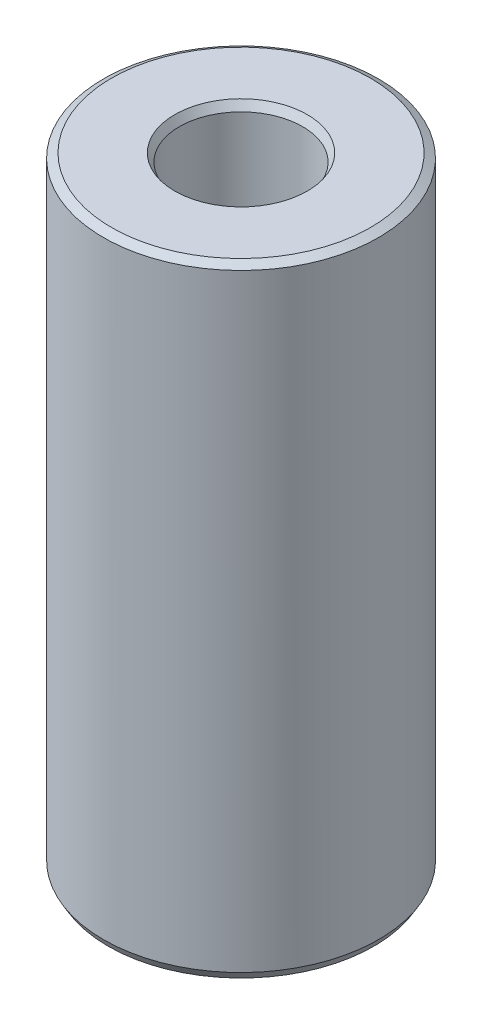
ISO-10303-21;
HEADER;
FILE_DESCRIPTION(('STEP AP214'),'2;1');
FILE_NAME('part.step','',(''),(''),'','','');
FILE_SCHEMA(('AUTOMOTIVE_DESIGN { 1 0 10303 214 1 1 1 1 }'));
ENDSEC;
DATA;
#1=APPLICATION_CONTEXT('core data for automotive mechanical design processes');
#2=APPLICATION_PROTOCOL_DEFINITION('international standard','automotive_design',2000,#1);
#3=PRODUCT_CONTEXT('',#1,'mechanical');
#4=PRODUCT('Part','Part','',(#3));
#5=PRODUCT_RELATED_PRODUCT_CATEGORY('part','',(#4));
#6=PRODUCT_DEFINITION_FORMATION('','',#4);
#7=PRODUCT_DEFINITION_CONTEXT('part definition',#1,'design');
#8=PRODUCT_DEFINITION('design','',#6,#7);
#9=PRODUCT_DEFINITION_SHAPE('','',#8);
#10=(LENGTH_UNIT() NAMED_UNIT(*) SI_UNIT(.MILLI.,.METRE.));
#11=(NAMED_UNIT(*) PLANE_ANGLE_UNIT() SI_UNIT($,.RADIAN.));
#12=(NAMED_UNIT(*) SI_UNIT($,.STERADIAN.) SOLID_ANGLE_UNIT());
#13=UNCERTAINTY_MEASURE_WITH_UNIT(LENGTH_MEASURE(1.E-05),#10,'distance_accuracy_value','');
#14=(GEOMETRIC_REPRESENTATION_CONTEXT(3) GLOBAL_UNCERTAINTY_ASSIGNED_CONTEXT((#13)) GLOBAL_UNIT_ASSIGNED_CONTEXT((#10,
#11,#12)) REPRESENTATION_CONTEXT('',''));
#15=CARTESIAN_POINT('',(0.,0.,0.));
#16=DIRECTION('',(0.,0.,1.));
#17=DIRECTION('',(1.,0.,0.));
#18=AXIS2_PLACEMENT_3D('',#15,#16,#17);
#19=CARTESIAN_POINT('',(0.,236.97446043715,0.));
#20=DIRECTION('',(0.,-1.,0.));
#21=DIRECTION('',(0.,0.,-1.));
#22=AXIS2_PLACEMENT_3D('',#19,#20,#21);
#23=CYLINDRICAL_SURFACE('',#22,52.5);
#24=CARTESIAN_POINT('',(0.,3.08121697017782,0.));
#25=DIRECTION('',(0.,1.,0.));
#26=DIRECTION('',(0.,0.,1.));
#27=AXIS2_PLACEMENT_3D('',#24,#25,#26);
#28=CIRCLE('',#27,52.5);
#29=CARTESIAN_POINT('',(0.,3.08121697017782,52.5));
#30=VERTEX_POINT('',#29);
#31=EDGE_CURVE('E10',#30,#30,#28,.T.);
#32=ORIENTED_EDGE('',*,*,#31,.T.);
#33=EDGE_LOOP('',(#32));
#34=FACE_BOUND('',#33,.T.);
#35=CARTESIAN_POINT('',(0.,235.195518989986,0.));
#36=DIRECTION('',(0.,1.,0.));
#37=DIRECTION('',(0.,0.,1.));
#38=AXIS2_PLACEMENT_3D('',#35,#36,#37);
#39=CIRCLE('',#38,52.5);
#40=CARTESIAN_POINT('',(0.,235.195518989986,-52.5));
#41=VERTEX_POINT('',#40);
#42=EDGE_CURVE('E50',#41,#41,#39,.F.);
#43=ORIENTED_EDGE('',*,*,#42,.T.);
#44=EDGE_LOOP('',(#43));
#45=FACE_BOUND('',#44,.T.);
#46=ADVANCED_FACE('F39',(#34,#45),#23,.T.);
#47=CARTESIAN_POINT('',(0.,236.97446043715,0.));
#48=DIRECTION('',(0.,1.,0.));
#49=DIRECTION('',(0.,0.,1.));
#50=AXIS2_PLACEMENT_3D('',#47,#48,#49);
#51=PLANE('',#50);
#52=CARTESIAN_POINT('',(0.,236.97446043715,0.));
#53=DIRECTION('',(0.,1.,0.));
#54=DIRECTION('',(0.,0.,1.));
#55=AXIS2_PLACEMENT_3D('',#52,#53,#54);
#56=CIRCLE('',#55,25.303635211718);
#57=CARTESIAN_POINT('',(0.,236.97446043715,25.303635211718));
#58=VERTEX_POINT('',#57);
#59=EDGE_CURVE('E58',#58,#58,#56,.F.);
#60=ORIENTED_EDGE('',*,*,#59,.T.);
#61=EDGE_LOOP('',(#60));
#62=FACE_BOUND('',#61,.T.);
#63=CARTESIAN_POINT('',(0.,236.97446043715,0.));
#64=DIRECTION('',(0.,1.,0.));
#65=DIRECTION('',(0.,0.,1.));
#66=AXIS2_PLACEMENT_3D('',#63,#64,#65);
#67=CIRCLE('',#66,49.4187830298221);
#68=CARTESIAN_POINT('',(0.,236.97446043715,-49.4187830298221));
#69=VERTEX_POINT('',#68);
#70=EDGE_CURVE('E61',#69,#69,#67,.T.);
#71=ORIENTED_EDGE('',*,*,#70,.T.);
#72=EDGE_LOOP('',(#71));
#73=FACE_BOUND('',#72,.T.);
#74=ADVANCED_FACE('F88',(#62,#73),#51,.T.);
#75=CARTESIAN_POINT('',(0.,0.,0.));
#76=DIRECTION('',(0.,1.,0.));
#77=DIRECTION('',(0.,0.,1.));
#78=AXIS2_PLACEMENT_3D('',#75,#76,#77);
#79=PLANE('',#78);
#80=CARTESIAN_POINT('',(0.,0.,0.));
#81=DIRECTION('',(0.,1.,0.));
#82=DIRECTION('',(0.,0.,1.));
#83=AXIS2_PLACEMENT_3D('',#80,#81,#82);
#84=CIRCLE('',#83,26.605910734732);
#85=CARTESIAN_POINT('',(0.,0.,26.605910734732));
#86=VERTEX_POINT('',#85);
#87=EDGE_CURVE('E51',#86,#86,#84,.T.);
#88=ORIENTED_EDGE('',*,*,#87,.T.);
#89=EDGE_LOOP('',(#88));
#90=FACE_BOUND('',#89,.T.);
#91=CARTESIAN_POINT('',(0.,0.,0.));
#92=DIRECTION('',(0.,1.,0.));
#93=DIRECTION('',(0.,0.,1.));
#94=AXIS2_PLACEMENT_3D('',#91,#92,#93);
#95=CIRCLE('',#94,50.7210585528362);
#96=CARTESIAN_POINT('',(0.,0.,50.7210585528362));
#97=VERTEX_POINT('',#96);
#98=EDGE_CURVE('E54',#97,#97,#95,.F.);
#99=ORIENTED_EDGE('',*,*,#98,.T.);
#100=EDGE_LOOP('',(#99));
#101=FACE_BOUND('',#100,.T.);
#102=ADVANCED_FACE('F83',(#90,#101),#79,.F.);
#103=CARTESIAN_POINT('',(0.,236.97446043715,0.));
#104=DIRECTION('',(0.,-1.,0.));
#105=DIRECTION('',(0.,0.,-1.));
#106=AXIS2_PLACEMENT_3D('',#103,#104,#105);
#107=CYLINDRICAL_SURFACE('',#106,23.5246937645542);
#108=CARTESIAN_POINT('',(0.,233.893243466972,0.));
#109=DIRECTION('',(0.,1.,0.));
#110=DIRECTION('',(0.,0.,1.));
#111=AXIS2_PLACEMENT_3D('',#108,#109,#110);
#112=CIRCLE('',#111,23.5246937645542);
#113=CARTESIAN_POINT('',(0.,233.893243466972,23.5246937645542));
#114=VERTEX_POINT('',#113);
#115=EDGE_CURVE('E67',#114,#114,#112,.T.);
#116=ORIENTED_EDGE('',*,*,#115,.T.);
#117=EDGE_LOOP('',(#116));
#118=FACE_BOUND('',#117,.T.);
#119=CARTESIAN_POINT('',(0.,1.77894144716378,0.));
#120=DIRECTION('',(0.,1.,0.));
#121=DIRECTION('',(0.,0.,1.));
#122=AXIS2_PLACEMENT_3D('',#119,#120,#121);
#123=CIRCLE('',#122,23.5246937645542);
#124=CARTESIAN_POINT('',(0.,1.77894144716378,23.5246937645542));
#125=VERTEX_POINT('',#124);
#126=EDGE_CURVE('E69',#125,#125,#123,.F.);
#127=ORIENTED_EDGE('',*,*,#126,.T.);
#128=EDGE_LOOP('',(#127));
#129=FACE_BOUND('',#128,.T.);
#130=ADVANCED_FACE('F71',(#118,#129),#107,.F.);
#131=CARTESIAN_POINT('',(0.,233.893243466972,0.));
#132=DIRECTION('',(0.,1.,0.));
#133=DIRECTION('',(0.,0.,1.));
#134=AXIS2_PLACEMENT_3D('',#131,#132,#133);
#135=CONICAL_SURFACE('',#134,23.5246937645542,0.5235987755983);
#136=ORIENTED_EDGE('',*,*,#59,.F.);
#137=EDGE_LOOP('',(#136));
#138=FACE_BOUND('',#137,.T.);
#139=ORIENTED_EDGE('',*,*,#115,.F.);
#140=EDGE_LOOP('',(#139));
#141=FACE_BOUND('',#140,.T.);
#142=ADVANCED_FACE('F77',(#138,#141),#135,.F.);
#143=CARTESIAN_POINT('',(0.,0.,0.));
#144=DIRECTION('',(0.,-1.,0.));
#145=DIRECTION('',(0.,0.,-1.));
#146=AXIS2_PLACEMENT_3D('',#143,#144,#145);
#147=CONICAL_SURFACE('',#146,26.605910734732,1.0471975511966);
#148=ORIENTED_EDGE('',*,*,#126,.F.);
#149=EDGE_LOOP('',(#148));
#150=FACE_BOUND('',#149,.T.);
#151=ORIENTED_EDGE('',*,*,#87,.F.);
#152=EDGE_LOOP('',(#151));
#153=FACE_BOUND('',#152,.T.);
#154=ADVANCED_FACE('F73',(#150,#153),#147,.F.);
#155=CARTESIAN_POINT('',(0.,3.08121697017782,0.));
#156=DIRECTION('',(0.,1.,0.));
#157=DIRECTION('',(0.,0.,1.));
#158=AXIS2_PLACEMENT_3D('',#155,#156,#157);
#159=CONICAL_SURFACE('',#158,52.5,0.523598775598301);
#160=ORIENTED_EDGE('',*,*,#98,.F.);
#161=EDGE_LOOP('',(#160));
#162=FACE_BOUND('',#161,.T.);
#163=ORIENTED_EDGE('',*,*,#31,.F.);
#164=EDGE_LOOP('',(#163));
#165=FACE_BOUND('',#164,.T.);
#166=ADVANCED_FACE('F76',(#162,#165),#159,.T.);
#167=CARTESIAN_POINT('',(0.,236.97446043715,0.));
#168=DIRECTION('',(0.,-1.,0.));
#169=DIRECTION('',(0.,0.,-1.));
#170=AXIS2_PLACEMENT_3D('',#167,#168,#169);
#171=CONICAL_SURFACE('',#170,49.4187830298221,1.0471975511966);
#172=CARTESIAN_POINT('',(0.,235.195518989986,-52.5));
#173=CARTESIAN_POINT('',(0.,235.21404963006,-52.467903989894));
#174=CARTESIAN_POINT('',(0.,235.232580270135,-52.435807979788));
#175=CARTESIAN_POINT('',(0.,235.269641550284,-52.3716159595759));
#176=CARTESIAN_POINT('',(0.,235.288172190359,-52.3395199494699));
#177=CARTESIAN_POINT('',(0.,235.325233470508,-52.2753279292579));
#178=CARTESIAN_POINT('',(0.,235.343764110583,-52.2432319191519));
#179=CARTESIAN_POINT('',(0.,235.380825390732,-52.1790398989398));
#180=CARTESIAN_POINT('',(0.,235.399356030807,-52.1469438888338));
#181=CARTESIAN_POINT('',(0.,235.436417310956,-52.0827518686218));
#182=CARTESIAN_POINT('',(0.,235.45494795103,-52.0506558585157));
#183=CARTESIAN_POINT('',(0.,235.49200923118,-51.9864638383037));
#184=CARTESIAN_POINT('',(0.,235.510539871254,-51.9543678281977));
#185=CARTESIAN_POINT('',(0.,235.547601151403,-51.8901758079856));
#186=CARTESIAN_POINT('',(0.,235.566131791478,-51.8580797978796));
#187=CARTESIAN_POINT('',(0.,235.603193071627,-51.7938877776676));
#188=CARTESIAN_POINT('',(0.,235.621723711702,-51.7617917675616));
#189=CARTESIAN_POINT('',(0.,235.658784991851,-51.6975997473495));
#190=CARTESIAN_POINT('',(0.,235.677315631926,-51.6655037372435));
#191=CARTESIAN_POINT('',(0.,235.714376912075,-51.6013117170315));
#192=CARTESIAN_POINT('',(0.,235.73290755215,-51.5692157069254));
#193=CARTESIAN_POINT('',(0.,235.769968832299,-51.5050236867134));
#194=CARTESIAN_POINT('',(0.,235.788499472374,-51.4729276766074));
#195=CARTESIAN_POINT('',(0.,235.825560752523,-51.4087356563954));
#196=CARTESIAN_POINT('',(0.,235.844091392597,-51.3766396462893));
#197=CARTESIAN_POINT('',(0.,235.881152672747,-51.3124476260773));
#198=CARTESIAN_POINT('',(0.,235.899683312821,-51.2803516159713));
#199=CARTESIAN_POINT('',(0.,235.936744592971,-51.2161595957592));
#200=CARTESIAN_POINT('',(0.,235.955275233045,-51.1840635856532));
#201=CARTESIAN_POINT('',(0.,235.992336513194,-51.1198715654412));
#202=CARTESIAN_POINT('',(0.,236.010867153269,-51.0877755553352));
#203=CARTESIAN_POINT('',(0.,236.047928433418,-51.0235835351231));
#204=CARTESIAN_POINT('',(0.,236.066459073493,-50.9914875250171));
#205=CARTESIAN_POINT('',(0.,236.103520353642,-50.9272955048051));
#206=CARTESIAN_POINT('',(0.,236.122050993717,-50.895199494699));
#207=CARTESIAN_POINT('',(0.,236.159112273866,-50.831007474487));
#208=CARTESIAN_POINT('',(0.,236.177642913941,-50.798911464381));
#209=CARTESIAN_POINT('',(0.,236.21470419409,-50.7347194441689));
#210=CARTESIAN_POINT('',(0.,236.233234834165,-50.7026234340629));
#211=CARTESIAN_POINT('',(0.,236.270296114314,-50.6384314138509));
#212=CARTESIAN_POINT('',(0.,236.288826754388,-50.6063354037449));
#213=CARTESIAN_POINT('',(0.,236.325888034538,-50.5421433835328));
#214=CARTESIAN_POINT('',(0.,236.344418674612,-50.5100473734268));
#215=CARTESIAN_POINT('',(0.,236.381479954762,-50.4458553532148));
#216=CARTESIAN_POINT('',(0.,236.400010594836,-50.4137593431087));
#217=CARTESIAN_POINT('',(0.,236.437071874985,-50.3495673228967));
#218=CARTESIAN_POINT('',(0.,236.45560251506,-50.3174713127907));
#219=CARTESIAN_POINT('',(0.,236.492663795209,-50.2532792925786));
#220=CARTESIAN_POINT('',(0.,236.511194435284,-50.2211832824726));
#221=CARTESIAN_POINT('',(0.,236.548255715433,-50.1569912622606));
#222=CARTESIAN_POINT('',(0.,236.566786355508,-50.1248952521546));
#223=CARTESIAN_POINT('',(0.,236.603847635657,-50.0607032319425));
#224=CARTESIAN_POINT('',(0.,236.622378275732,-50.0286072218365));
#225=CARTESIAN_POINT('',(0.,236.659439555881,-49.9644152016245));
#226=CARTESIAN_POINT('',(0.,236.677970195956,-49.9323191915184));
#227=CARTESIAN_POINT('',(0.,236.715031476105,-49.8681271713064));
#228=CARTESIAN_POINT('',(0.,236.733562116179,-49.8360311612004));
#229=CARTESIAN_POINT('',(0.,236.770623396329,-49.7718391409884));
#230=CARTESIAN_POINT('',(0.,236.789154036403,-49.7397431308823));
#231=CARTESIAN_POINT('',(0.,236.826215316553,-49.6755511106703));
#232=CARTESIAN_POINT('',(0.,236.844745956627,-49.6434551005643));
#233=CARTESIAN_POINT('',(0.,236.881807236776,-49.5792630803522));
#234=CARTESIAN_POINT('',(0.,236.900337876851,-49.5471670702462));
#235=CARTESIAN_POINT('',(0.,236.937399157,-49.4829750500342));
#236=CARTESIAN_POINT('',(0.,236.955929797075,-49.4508790399281));
#237=CARTESIAN_POINT('',(0.,236.97446043715,-49.4187830298221));
#238=B_SPLINE_CURVE_WITH_KNOTS('',3,(#172,#173,#174,#175,#176,#177,#178,#179,#180,#181,#182,
#183,#184,#185,#186,#187,#188,#189,#190,#191,#192,#193,#194,#195,#196,#197,#198,#199,#200,#201,
#202,#203,#204,#205,#206,#207,#208,#209,#210,#211,#212,#213,#214,#215,#216,#217,#218,#219,#220,
#221,#222,#223,#224,#225,#226,#227,#228,#229,#230,#231,#232,#233,#234,#235,#236,#237),
.UNSPECIFIED.,.F.,.F.,(4,2,2,2,2,2,2,2,2,2,2,2,2,2,2,2,2,2,2,2,2,2,2,2,2,2,2,2,2,2,2,2,4),(0.,
0.111183840447732,0.22236768089547,0.333551521343208,0.44473536179096,0.555919202238693,
0.667103042686431,0.778286883134169,0.889470723581921,1.00065456402966,1.11183840447739,
1.22302224492513,1.33420608537288,1.44538992582062,1.55657376626835,1.66775760671609,
1.77894144716384,1.89012528761158,2.00130912805932,2.11249296850705,2.2236768089548,
2.33486064940254,2.44604448985028,2.55722833029802,2.66841217074576,2.7795960111935,
2.89077985164124,3.00196369208898,3.11314753253672,3.22433137298446,3.3355152134322,
3.44669905387994,3.55788289432769),.UNSPECIFIED.);
#239=EDGE_CURVE('BSEAM45',#41,#69,#238,.T.);
#240=ORIENTED_EDGE('',*,*,#42,.F.);
#241=ORIENTED_EDGE('',*,*,#70,.F.);
#242=ORIENTED_EDGE('',*,*,#239,.T.);
#243=ORIENTED_EDGE('',*,*,#239,.F.);
#244=EDGE_LOOP('',(#240,#242,#241,#243));
#245=FACE_BOUND('',#244,.T.);
#246=ADVANCED_FACE('F45',(#245),#171,.T.);
#247=CLOSED_SHELL('',(#46,#74,#102,#130,#142,#154,#166,#246));
#248=MANIFOLD_SOLID_BREP('B2',#247);
#249=ADVANCED_BREP_SHAPE_REPRESENTATION('',(#18,#248),#14);
#250=SHAPE_DEFINITION_REPRESENTATION(#9,#249);
ENDSEC;
END-ISO-10303-21;
